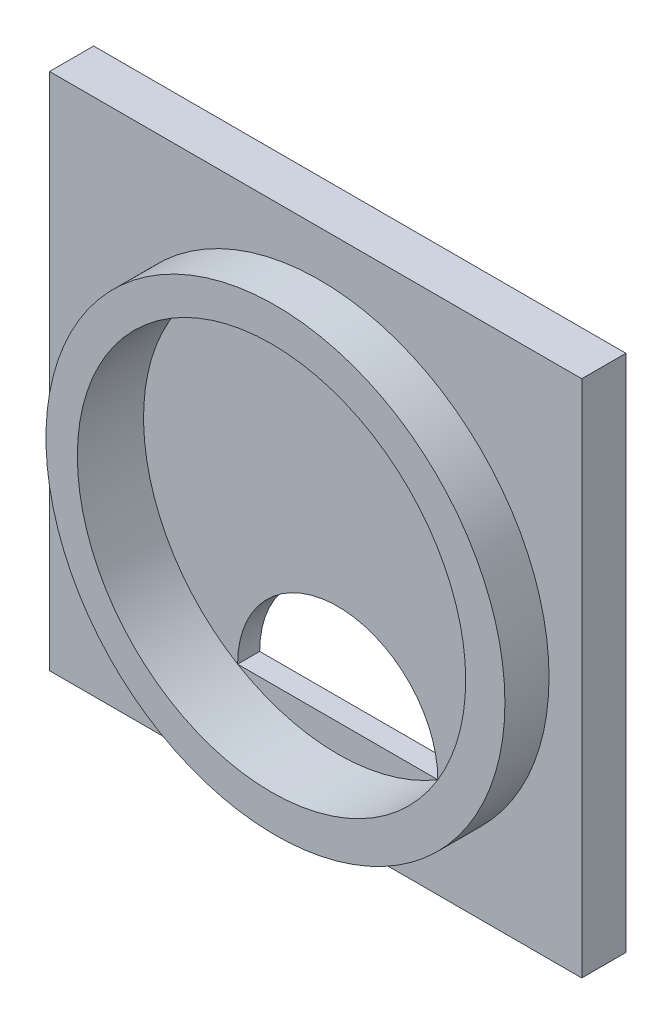
ISO-10303-21;
HEADER;
FILE_DESCRIPTION(('STEP AP214'),'2;1');
FILE_NAME('part.step','',(''),(''),'','','');
FILE_SCHEMA(('AUTOMOTIVE_DESIGN { 1 0 10303 214 1 1 1 1 }'));
ENDSEC;
DATA;
#1=APPLICATION_CONTEXT('core data for automotive mechanical design processes');
#2=APPLICATION_PROTOCOL_DEFINITION('international standard','automotive_design',2000,#1);
#3=PRODUCT_CONTEXT('',#1,'mechanical');
#4=PRODUCT('Part','Part','',(#3));
#5=PRODUCT_RELATED_PRODUCT_CATEGORY('part','',(#4));
#6=PRODUCT_DEFINITION_FORMATION('','',#4);
#7=PRODUCT_DEFINITION_CONTEXT('part definition',#1,'design');
#8=PRODUCT_DEFINITION('design','',#6,#7);
#9=PRODUCT_DEFINITION_SHAPE('','',#8);
#10=(LENGTH_UNIT() NAMED_UNIT(*) SI_UNIT(.MILLI.,.METRE.));
#11=(NAMED_UNIT(*) PLANE_ANGLE_UNIT() SI_UNIT($,.RADIAN.));
#12=(NAMED_UNIT(*) SI_UNIT($,.STERADIAN.) SOLID_ANGLE_UNIT());
#13=UNCERTAINTY_MEASURE_WITH_UNIT(LENGTH_MEASURE(1.E-05),#10,'distance_accuracy_value','');
#14=(GEOMETRIC_REPRESENTATION_CONTEXT(3) GLOBAL_UNCERTAINTY_ASSIGNED_CONTEXT((#13)) GLOBAL_UNIT_ASSIGNED_CONTEXT((#10,
#11,#12)) REPRESENTATION_CONTEXT('',''));
#15=CARTESIAN_POINT('',(0.,0.,0.));
#16=DIRECTION('',(0.,0.,1.));
#17=DIRECTION('',(1.,0.,0.));
#18=AXIS2_PLACEMENT_3D('',#15,#16,#17);
#19=CARTESIAN_POINT('',(0.,0.,0.));
#20=DIRECTION('',(0.,0.,1.));
#21=DIRECTION('',(1.,0.,0.));
#22=AXIS2_PLACEMENT_3D('',#19,#20,#21);
#23=PLANE('',#22);
#24=DIRECTION('',(0.,1.,0.));
#25=VECTOR('',#24,1.);
#26=CARTESIAN_POINT('',(30.15,31.15,0.));
#27=LINE('',#26,#25);
#28=CARTESIAN_POINT('',(30.15,-27.65,0.));
#29=VERTEX_POINT('',#28);
#30=CARTESIAN_POINT('',(30.15,31.15,0.));
#31=VERTEX_POINT('',#30);
#32=EDGE_CURVE('E125',#29,#31,#27,.T.);
#33=ORIENTED_EDGE('',*,*,#32,.T.);
#34=DIRECTION('',(-1.,0.,0.));
#35=VECTOR('',#34,1.);
#36=CARTESIAN_POINT('',(-30.15,31.15,0.));
#37=LINE('',#36,#35);
#38=CARTESIAN_POINT('',(-30.15,31.15,0.));
#39=VERTEX_POINT('',#38);
#40=EDGE_CURVE('E140',#31,#39,#37,.T.);
#41=ORIENTED_EDGE('',*,*,#40,.T.);
#42=DIRECTION('',(0.,-1.,0.));
#43=VECTOR('',#42,1.);
#44=CARTESIAN_POINT('',(-30.15,31.15,0.));
#45=LINE('',#44,#43);
#46=CARTESIAN_POINT('',(-30.15,-27.65,0.));
#47=VERTEX_POINT('',#46);
#48=EDGE_CURVE('E143',#39,#47,#45,.T.);
#49=ORIENTED_EDGE('',*,*,#48,.T.);
#50=DIRECTION('',(1.,0.,0.));
#51=VECTOR('',#50,1.);
#52=CARTESIAN_POINT('',(-30.15,-27.65,0.));
#53=LINE('',#52,#51);
#54=EDGE_CURVE('E130',#47,#29,#53,.T.);
#55=ORIENTED_EDGE('',*,*,#54,.T.);
#56=EDGE_LOOP('',(#33,#41,#49,#55));
#57=FACE_BOUND('',#56,.T.);
#58=CARTESIAN_POINT('',(0.443922203828606,0.,0.));
#59=DIRECTION('',(0.,0.,1.));
#60=DIRECTION('',(1.,0.,0.));
#61=AXIS2_PLACEMENT_3D('',#58,#59,#60);
#62=CIRCLE('',#61,26.);
#63=CARTESIAN_POINT('',(26.4439222038286,0.,0.));
#64=VERTEX_POINT('',#63);
#65=EDGE_CURVE('E121',#64,#64,#62,.T.);
#66=ORIENTED_EDGE('',*,*,#65,.F.);
#67=EDGE_LOOP('',(#66));
#68=FACE_BOUND('',#67,.T.);
#69=ADVANCED_FACE('F35',(#57,#68),#23,.T.);
#70=CARTESIAN_POINT('',(30.15,31.15,-5.));
#71=DIRECTION('',(1.,0.,0.));
#72=DIRECTION('',(0.,0.,-1.));
#73=AXIS2_PLACEMENT_3D('',#70,#71,#72);
#74=PLANE('',#73);
#75=DIRECTION('',(0.,0.,1.));
#76=VECTOR('',#75,1.);
#77=CARTESIAN_POINT('',(30.15,31.15,-5.));
#78=LINE('',#77,#76);
#79=CARTESIAN_POINT('',(30.15,31.15,-5.));
#80=VERTEX_POINT('',#79);
#81=EDGE_CURVE('E137',#80,#31,#78,.T.);
#82=ORIENTED_EDGE('',*,*,#81,.T.);
#83=ORIENTED_EDGE('',*,*,#32,.F.);
#84=DIRECTION('',(0.,0.,1.));
#85=VECTOR('',#84,1.);
#86=CARTESIAN_POINT('',(30.15,-27.65,-5.));
#87=LINE('',#86,#85);
#88=CARTESIAN_POINT('',(30.15,-27.65,-5.));
#89=VERTEX_POINT('',#88);
#90=EDGE_CURVE('E58',#89,#29,#87,.T.);
#91=ORIENTED_EDGE('',*,*,#90,.F.);
#92=DIRECTION('',(0.,1.,0.));
#93=VECTOR('',#92,1.);
#94=CARTESIAN_POINT('',(30.15,31.15,-5.));
#95=LINE('',#94,#93);
#96=EDGE_CURVE('E80',#89,#80,#95,.T.);
#97=ORIENTED_EDGE('',*,*,#96,.T.);
#98=EDGE_LOOP('',(#82,#83,#91,#97));
#99=FACE_BOUND('',#98,.T.);
#100=ADVANCED_FACE('F37',(#99),#74,.T.);
#101=CARTESIAN_POINT('',(-30.15,-27.65,-5.));
#102=DIRECTION('',(0.,-1.,0.));
#103=DIRECTION('',(1.,0.,0.));
#104=AXIS2_PLACEMENT_3D('',#101,#102,#103);
#105=PLANE('',#104);
#106=ORIENTED_EDGE('',*,*,#54,.F.);
#107=DIRECTION('',(0.,0.,1.));
#108=VECTOR('',#107,1.);
#109=CARTESIAN_POINT('',(-30.15,-27.65,-5.));
#110=LINE('',#109,#108);
#111=CARTESIAN_POINT('',(-30.15,-27.65,-5.));
#112=VERTEX_POINT('',#111);
#113=EDGE_CURVE('E149',#112,#47,#110,.T.);
#114=ORIENTED_EDGE('',*,*,#113,.F.);
#115=DIRECTION('',(1.,0.,0.));
#116=VECTOR('',#115,1.);
#117=CARTESIAN_POINT('',(-30.15,-27.65,-5.));
#118=LINE('',#117,#116);
#119=EDGE_CURVE('E135',#112,#89,#118,.T.);
#120=ORIENTED_EDGE('',*,*,#119,.T.);
#121=ORIENTED_EDGE('',*,*,#90,.T.);
#122=EDGE_LOOP('',(#106,#114,#120,#121));
#123=FACE_BOUND('',#122,.T.);
#124=ADVANCED_FACE('F177',(#123),#105,.T.);
#125=CARTESIAN_POINT('',(-30.15,31.15,-5.));
#126=DIRECTION('',(-1.,0.,0.));
#127=DIRECTION('',(0.,0.,1.));
#128=AXIS2_PLACEMENT_3D('',#125,#126,#127);
#129=PLANE('',#128);
#130=ORIENTED_EDGE('',*,*,#48,.F.);
#131=DIRECTION('',(0.,0.,1.));
#132=VECTOR('',#131,1.);
#133=CARTESIAN_POINT('',(-30.15,31.15,-5.));
#134=LINE('',#133,#132);
#135=CARTESIAN_POINT('',(-30.15,31.15,-5.));
#136=VERTEX_POINT('',#135);
#137=EDGE_CURVE('E151',#136,#39,#134,.T.);
#138=ORIENTED_EDGE('',*,*,#137,.F.);
#139=DIRECTION('',(0.,-1.,0.));
#140=VECTOR('',#139,1.);
#141=CARTESIAN_POINT('',(-30.15,31.15,-5.));
#142=LINE('',#141,#140);
#143=EDGE_CURVE('E133',#136,#112,#142,.T.);
#144=ORIENTED_EDGE('',*,*,#143,.T.);
#145=ORIENTED_EDGE('',*,*,#113,.T.);
#146=EDGE_LOOP('',(#130,#138,#144,#145));
#147=FACE_BOUND('',#146,.T.);
#148=ADVANCED_FACE('F183',(#147),#129,.T.);
#149=CARTESIAN_POINT('',(-30.15,31.15,-5.));
#150=DIRECTION('',(0.,1.,0.));
#151=DIRECTION('',(0.,0.,1.));
#152=AXIS2_PLACEMENT_3D('',#149,#150,#151);
#153=PLANE('',#152);
#154=ORIENTED_EDGE('',*,*,#40,.F.);
#155=ORIENTED_EDGE('',*,*,#81,.F.);
#156=DIRECTION('',(-1.,0.,0.));
#157=VECTOR('',#156,1.);
#158=CARTESIAN_POINT('',(-30.15,31.15,-5.));
#159=LINE('',#158,#157);
#160=EDGE_CURVE('E129',#80,#136,#159,.T.);
#161=ORIENTED_EDGE('',*,*,#160,.T.);
#162=ORIENTED_EDGE('',*,*,#137,.T.);
#163=EDGE_LOOP('',(#154,#155,#161,#162));
#164=FACE_BOUND('',#163,.T.);
#165=ADVANCED_FACE('F185',(#164),#153,.T.);
#166=CARTESIAN_POINT('',(0.,0.,-5.));
#167=DIRECTION('',(0.,0.,1.));
#168=DIRECTION('',(1.,0.,0.));
#169=AXIS2_PLACEMENT_3D('',#166,#167,#168);
#170=PLANE('',#169);
#171=CARTESIAN_POINT('',(0.,-18.85,-5.));
#172=DIRECTION('',(0.,0.,1.));
#173=DIRECTION('',(1.,0.,0.));
#174=AXIS2_PLACEMENT_3D('',#171,#172,#173);
#175=CIRCLE('',#174,11.3436105363328);
#176=CARTESIAN_POINT('',(-11.3436105363328,-18.85,-5.));
#177=VERTEX_POINT('',#176);
#178=CARTESIAN_POINT('',(11.3436105363328,-18.85,-5.00000000000001));
#179=VERTEX_POINT('',#178);
#180=EDGE_CURVE('E93',#177,#179,#175,.F.);
#181=ORIENTED_EDGE('',*,*,#180,.F.);
#182=DIRECTION('',(-1.,0.,0.));
#183=VECTOR('',#182,1.);
#184=CARTESIAN_POINT('',(0.,-18.85,-5.));
#185=LINE('',#184,#183);
#186=EDGE_CURVE('E104',#179,#177,#185,.T.);
#187=ORIENTED_EDGE('',*,*,#186,.F.);
#188=EDGE_LOOP('',(#181,#187));
#189=FACE_BOUND('',#188,.T.);
#190=ORIENTED_EDGE('',*,*,#119,.F.);
#191=ORIENTED_EDGE('',*,*,#143,.F.);
#192=ORIENTED_EDGE('',*,*,#160,.F.);
#193=ORIENTED_EDGE('',*,*,#96,.F.);
#194=EDGE_LOOP('',(#190,#191,#192,#193));
#195=FACE_BOUND('',#194,.T.);
#196=ADVANCED_FACE('F105',(#189,#195),#170,.F.);
#197=CARTESIAN_POINT('',(0.,0.,-5.));
#198=DIRECTION('',(0.,0.,1.));
#199=DIRECTION('',(1.,0.,0.));
#200=AXIS2_PLACEMENT_3D('',#197,#198,#199);
#201=CYLINDRICAL_SURFACE('',#200,22.);
#202=CARTESIAN_POINT('',(0.,0.,-2.5));
#203=DIRECTION('',(0.,0.,1.));
#204=DIRECTION('',(1.,0.,0.));
#205=AXIS2_PLACEMENT_3D('',#202,#203,#204);
#206=CIRCLE('',#205,22.);
#207=CARTESIAN_POINT('',(-11.3436105363328,-18.85,-2.5));
#208=VERTEX_POINT('',#207);
#209=CARTESIAN_POINT('',(11.3436105363328,-18.85,-2.5));
#210=VERTEX_POINT('',#209);
#211=EDGE_CURVE('E43',#208,#210,#206,.F.);
#212=ORIENTED_EDGE('',*,*,#211,.T.);
#213=CARTESIAN_POINT('',(0.,0.,-2.5));
#214=DIRECTION('',(0.,0.,1.));
#215=DIRECTION('',(1.,0.,0.));
#216=AXIS2_PLACEMENT_3D('',#213,#214,#215);
#217=CIRCLE('',#216,22.);
#218=EDGE_CURVE('E49',#208,#210,#217,.T.);
#219=ORIENTED_EDGE('',*,*,#218,.F.);
#220=EDGE_LOOP('',(#212,#219));
#221=FACE_BOUND('',#220,.T.);
#222=CARTESIAN_POINT('',(0.,0.,5.));
#223=DIRECTION('',(0.,0.,1.));
#224=DIRECTION('',(1.,0.,0.));
#225=AXIS2_PLACEMENT_3D('',#222,#223,#224);
#226=CIRCLE('',#225,22.);
#227=CARTESIAN_POINT('',(22.,0.,5.));
#228=VERTEX_POINT('',#227);
#229=EDGE_CURVE('E101',#228,#228,#226,.T.);
#230=ORIENTED_EDGE('',*,*,#229,.T.);
#231=EDGE_LOOP('',(#230));
#232=FACE_BOUND('',#231,.T.);
#233=ADVANCED_FACE('F155',(#221,#232),#201,.F.);
#234=CARTESIAN_POINT('',(30.15,-18.85,-2.50000000000001));
#235=DIRECTION('',(0.,0.,1.));
#236=DIRECTION('',(1.,0.,0.));
#237=AXIS2_PLACEMENT_3D('',#234,#235,#236);
#238=PLANE('',#237);
#239=CARTESIAN_POINT('',(0.,-18.85,-2.5));
#240=DIRECTION('',(0.,0.,1.));
#241=DIRECTION('',(-1.,0.,0.));
#242=AXIS2_PLACEMENT_3D('',#239,#240,#241);
#243=CIRCLE('',#242,11.3436105363328);
#244=EDGE_CURVE('E102',#210,#208,#243,.T.);
#245=ORIENTED_EDGE('',*,*,#244,.F.);
#246=ORIENTED_EDGE('',*,*,#211,.F.);
#247=EDGE_LOOP('',(#245,#246));
#248=FACE_BOUND('',#247,.T.);
#249=ADVANCED_FACE('F158',(#248),#238,.T.);
#250=CARTESIAN_POINT('',(0.443922203828606,0.,5.));
#251=DIRECTION('',(0.,0.,1.));
#252=DIRECTION('',(1.,0.,0.));
#253=AXIS2_PLACEMENT_3D('',#250,#251,#252);
#254=PLANE('',#253);
#255=CARTESIAN_POINT('',(0.443922203828606,0.,5.));
#256=DIRECTION('',(0.,0.,1.));
#257=DIRECTION('',(1.,0.,0.));
#258=AXIS2_PLACEMENT_3D('',#255,#256,#257);
#259=CIRCLE('',#258,26.);
#260=CARTESIAN_POINT('',(26.4439222038286,0.,5.));
#261=VERTEX_POINT('',#260);
#262=EDGE_CURVE('E122',#261,#261,#259,.T.);
#263=ORIENTED_EDGE('',*,*,#262,.T.);
#264=EDGE_LOOP('',(#263));
#265=FACE_BOUND('',#264,.T.);
#266=ORIENTED_EDGE('',*,*,#229,.F.);
#267=EDGE_LOOP('',(#266));
#268=FACE_BOUND('',#267,.T.);
#269=ADVANCED_FACE('F160',(#265,#268),#254,.T.);
#270=CARTESIAN_POINT('',(0.443922203828606,0.,5.));
#271=DIRECTION('',(0.,0.,-1.));
#272=DIRECTION('',(-1.,0.,0.));
#273=AXIS2_PLACEMENT_3D('',#270,#271,#272);
#274=CYLINDRICAL_SURFACE('',#273,26.);
#275=ORIENTED_EDGE('',*,*,#262,.F.);
#276=EDGE_LOOP('',(#275));
#277=FACE_BOUND('',#276,.T.);
#278=ORIENTED_EDGE('',*,*,#65,.T.);
#279=EDGE_LOOP('',(#278));
#280=FACE_BOUND('',#279,.T.);
#281=ADVANCED_FACE('F166',(#277,#280),#274,.T.);
#282=CARTESIAN_POINT('',(0.,-18.85,-30.3650842695229));
#283=DIRECTION('',(0.,0.,1.));
#284=DIRECTION('',(1.,0.,0.));
#285=AXIS2_PLACEMENT_3D('',#282,#283,#284);
#286=CYLINDRICAL_SURFACE('',#285,11.3436105363328);
#287=ORIENTED_EDGE('',*,*,#180,.T.);
#288=DIRECTION('',(0.,0.,1.));
#289=VECTOR('',#288,1.);
#290=CARTESIAN_POINT('',(11.3436105363328,-18.85,-5.));
#291=LINE('',#290,#289);
#292=EDGE_CURVE('E11',#210,#179,#291,.F.);
#293=ORIENTED_EDGE('',*,*,#292,.F.);
#294=ORIENTED_EDGE('',*,*,#244,.T.);
#295=DIRECTION('',(0.,0.,1.));
#296=VECTOR('',#295,1.);
#297=CARTESIAN_POINT('',(-11.3436105363328,-18.85,-5.));
#298=LINE('',#297,#296);
#299=EDGE_CURVE('E98',#177,#208,#298,.T.);
#300=ORIENTED_EDGE('',*,*,#299,.F.);
#301=EDGE_LOOP('',(#287,#293,#294,#300));
#302=FACE_BOUND('',#301,.T.);
#303=ADVANCED_FACE('F95',(#302),#286,.F.);
#304=CARTESIAN_POINT('',(0.,-18.85,-27.9048575634078));
#305=DIRECTION('',(0.,-1.,0.));
#306=DIRECTION('',(0.,0.,-1.));
#307=AXIS2_PLACEMENT_3D('',#304,#305,#306);
#308=PLANE('',#307);
#309=ORIENTED_EDGE('',*,*,#292,.T.);
#310=ORIENTED_EDGE('',*,*,#186,.T.);
#311=ORIENTED_EDGE('',*,*,#299,.T.);
#312=DIRECTION('',(1.,0.,0.));
#313=VECTOR('',#312,1.);
#314=CARTESIAN_POINT('',(0.,-18.85,-2.5));
#315=LINE('',#314,#313);
#316=EDGE_CURVE('E112',#208,#210,#315,.T.);
#317=ORIENTED_EDGE('',*,*,#316,.T.);
#318=EDGE_LOOP('',(#309,#310,#311,#317));
#319=FACE_BOUND('',#318,.T.);
#320=ADVANCED_FACE('F110',(#319),#308,.F.);
#321=CARTESIAN_POINT('',(0.,0.,-2.5));
#322=DIRECTION('',(0.,0.,1.));
#323=DIRECTION('',(1.,0.,0.));
#324=AXIS2_PLACEMENT_3D('',#321,#322,#323);
#325=PLANE('',#324);
#326=ORIENTED_EDGE('',*,*,#316,.F.);
#327=ORIENTED_EDGE('',*,*,#218,.T.);
#328=EDGE_LOOP('',(#326,#327));
#329=FACE_BOUND('',#328,.T.);
#330=ADVANCED_FACE('F115',(#329),#325,.T.);
#331=CLOSED_SHELL('',(#69,#100,#124,#148,#165,#196,#233,#249,#269,#281,#303,#320,#330));
#332=MANIFOLD_SOLID_BREP('B2',#331);
#333=ADVANCED_BREP_SHAPE_REPRESENTATION('',(#18,#332),#14);
#334=SHAPE_DEFINITION_REPRESENTATION(#9,#333);
ENDSEC;
END-ISO-10303-21;
